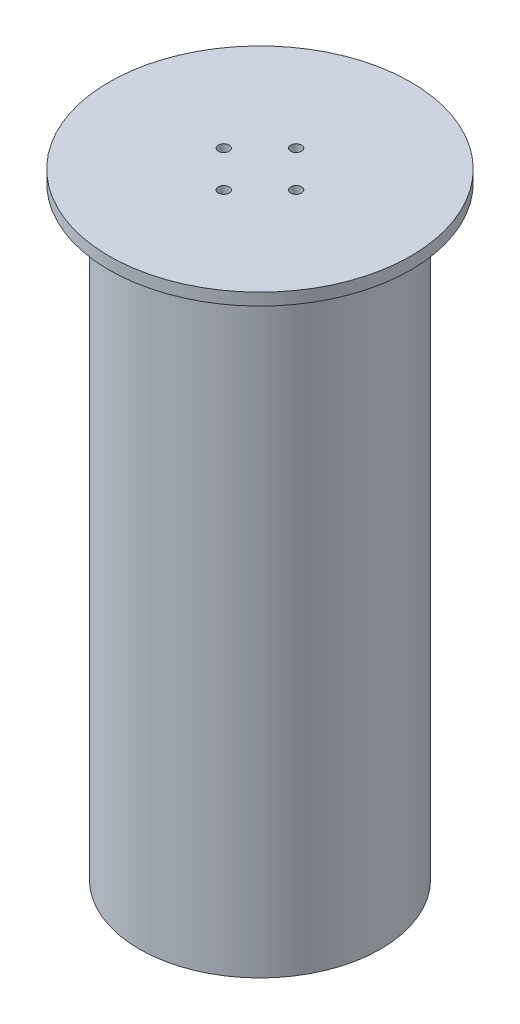
ISO-10303-21;
HEADER;
FILE_DESCRIPTION(('STEP AP214'),'2;1');
FILE_NAME('part.step','',(''),(''),'','','');
FILE_SCHEMA(('AUTOMOTIVE_DESIGN { 1 0 10303 214 1 1 1 1 }'));
ENDSEC;
DATA;
#1=APPLICATION_CONTEXT('core data for automotive mechanical design processes');
#2=APPLICATION_PROTOCOL_DEFINITION('international standard','automotive_design',2000,#1);
#3=PRODUCT_CONTEXT('',#1,'mechanical');
#4=PRODUCT('Part','Part','',(#3));
#5=PRODUCT_RELATED_PRODUCT_CATEGORY('part','',(#4));
#6=PRODUCT_DEFINITION_FORMATION('','',#4);
#7=PRODUCT_DEFINITION_CONTEXT('part definition',#1,'design');
#8=PRODUCT_DEFINITION('design','',#6,#7);
#9=PRODUCT_DEFINITION_SHAPE('','',#8);
#10=(LENGTH_UNIT() NAMED_UNIT(*) SI_UNIT(.MILLI.,.METRE.));
#11=(NAMED_UNIT(*) PLANE_ANGLE_UNIT() SI_UNIT($,.RADIAN.));
#12=(NAMED_UNIT(*) SI_UNIT($,.STERADIAN.) SOLID_ANGLE_UNIT());
#13=UNCERTAINTY_MEASURE_WITH_UNIT(LENGTH_MEASURE(1.E-05),#10,'distance_accuracy_value','');
#14=(GEOMETRIC_REPRESENTATION_CONTEXT(3) GLOBAL_UNCERTAINTY_ASSIGNED_CONTEXT((#13)) GLOBAL_UNIT_ASSIGNED_CONTEXT((#10,
#11,#12)) REPRESENTATION_CONTEXT('',''));
#15=CARTESIAN_POINT('',(0.,0.,0.));
#16=DIRECTION('',(0.,0.,1.));
#17=DIRECTION('',(1.,0.,0.));
#18=AXIS2_PLACEMENT_3D('',#15,#16,#17);
#19=CARTESIAN_POINT('',(94.0000000000001,10.,0.));
#20=DIRECTION('',(0.,1.,0.));
#21=DIRECTION('',(-1.,0.,0.));
#22=AXIS2_PLACEMENT_3D('',#19,#20,#21);
#23=PLANE('',#22);
#24=CARTESIAN_POINT('',(0.,10.,0.));
#25=DIRECTION('',(0.,-1.,0.));
#26=DIRECTION('',(1.,0.,0.));
#27=AXIS2_PLACEMENT_3D('',#24,#25,#26);
#28=CIRCLE('',#27,88.0000000000001);
#29=CARTESIAN_POINT('',(88.0000000000001,10.,0.));
#30=VERTEX_POINT('',#29);
#31=EDGE_CURVE('E10',#30,#30,#28,.T.);
#32=ORIENTED_EDGE('',*,*,#31,.T.);
#33=EDGE_LOOP('',(#32));
#34=FACE_BOUND('',#33,.T.);
#35=CARTESIAN_POINT('',(0.,10.,0.));
#36=DIRECTION('',(0.,-1.,0.));
#37=DIRECTION('',(1.,0.,0.));
#38=AXIS2_PLACEMENT_3D('',#35,#36,#37);
#39=CIRCLE('',#38,94.0000000000001);
#40=CARTESIAN_POINT('',(94.0000000000001,10.,0.));
#41=VERTEX_POINT('',#40);
#42=EDGE_CURVE('E61',#41,#41,#39,.T.);
#43=ORIENTED_EDGE('',*,*,#42,.F.);
#44=EDGE_LOOP('',(#43));
#45=FACE_BOUND('',#44,.T.);
#46=ADVANCED_FACE('F33',(#34,#45),#23,.T.);
#47=CARTESIAN_POINT('',(0.,0.,0.));
#48=DIRECTION('',(0.,-1.,0.));
#49=DIRECTION('',(1.,0.,0.));
#50=AXIS2_PLACEMENT_3D('',#47,#48,#49);
#51=CYLINDRICAL_SURFACE('',#50,88.0000000000001);
#52=CARTESIAN_POINT('',(0.,0.,0.));
#53=DIRECTION('',(0.,-1.,0.));
#54=DIRECTION('',(1.,0.,0.));
#55=AXIS2_PLACEMENT_3D('',#52,#53,#54);
#56=CIRCLE('',#55,88.0000000000001);
#57=CARTESIAN_POINT('',(88.0000000000001,0.,0.));
#58=VERTEX_POINT('',#57);
#59=EDGE_CURVE('E39',#58,#58,#56,.T.);
#60=ORIENTED_EDGE('',*,*,#59,.T.);
#61=EDGE_LOOP('',(#60));
#62=FACE_BOUND('',#61,.T.);
#63=ORIENTED_EDGE('',*,*,#31,.F.);
#64=EDGE_LOOP('',(#63));
#65=FACE_BOUND('',#64,.T.);
#66=ADVANCED_FACE('F125',(#62,#65),#51,.F.);
#67=CARTESIAN_POINT('',(88.0000000000001,0.,0.));
#68=DIRECTION('',(0.,-1.,0.));
#69=DIRECTION('',(1.,0.,0.));
#70=AXIS2_PLACEMENT_3D('',#67,#68,#69);
#71=PLANE('',#70);
#72=CARTESIAN_POINT('',(0.,0.,0.));
#73=DIRECTION('',(0.,-1.,0.));
#74=DIRECTION('',(1.,0.,0.));
#75=AXIS2_PLACEMENT_3D('',#72,#73,#74);
#76=CIRCLE('',#75,100.);
#77=CARTESIAN_POINT('',(100.,0.,0.));
#78=VERTEX_POINT('',#77);
#79=EDGE_CURVE('E43',#78,#78,#76,.T.);
#80=ORIENTED_EDGE('',*,*,#79,.T.);
#81=EDGE_LOOP('',(#80));
#82=FACE_BOUND('',#81,.T.);
#83=ORIENTED_EDGE('',*,*,#59,.F.);
#84=EDGE_LOOP('',(#83));
#85=FACE_BOUND('',#84,.T.);
#86=ADVANCED_FACE('F119',(#82,#85),#71,.T.);
#87=CARTESIAN_POINT('',(0.,0.,0.));
#88=DIRECTION('',(0.,-1.,0.));
#89=DIRECTION('',(1.,0.,0.));
#90=AXIS2_PLACEMENT_3D('',#87,#88,#89);
#91=CYLINDRICAL_SURFACE('',#90,100.);
#92=CARTESIAN_POINT('',(0.,500.,0.));
#93=DIRECTION('',(0.,-1.,0.));
#94=DIRECTION('',(1.,0.,0.));
#95=AXIS2_PLACEMENT_3D('',#92,#93,#94);
#96=CIRCLE('',#95,100.);
#97=CARTESIAN_POINT('',(100.,500.,0.));
#98=VERTEX_POINT('',#97);
#99=EDGE_CURVE('E47',#98,#98,#96,.T.);
#100=ORIENTED_EDGE('',*,*,#99,.T.);
#101=EDGE_LOOP('',(#100));
#102=FACE_BOUND('',#101,.T.);
#103=ORIENTED_EDGE('',*,*,#79,.F.);
#104=EDGE_LOOP('',(#103));
#105=FACE_BOUND('',#104,.T.);
#106=ADVANCED_FACE('F113',(#102,#105),#91,.T.);
#107=CARTESIAN_POINT('',(125.,500.,0.));
#108=DIRECTION('',(0.,-1.,0.));
#109=DIRECTION('',(1.,0.,0.));
#110=AXIS2_PLACEMENT_3D('',#107,#108,#109);
#111=PLANE('',#110);
#112=CARTESIAN_POINT('',(0.,500.,0.));
#113=DIRECTION('',(0.,-1.,0.));
#114=DIRECTION('',(1.,0.,0.));
#115=AXIS2_PLACEMENT_3D('',#112,#113,#114);
#116=CIRCLE('',#115,125.);
#117=CARTESIAN_POINT('',(125.,500.,0.));
#118=VERTEX_POINT('',#117);
#119=EDGE_CURVE('E52',#118,#118,#116,.T.);
#120=ORIENTED_EDGE('',*,*,#119,.T.);
#121=EDGE_LOOP('',(#120));
#122=FACE_BOUND('',#121,.T.);
#123=ORIENTED_EDGE('',*,*,#99,.F.);
#124=EDGE_LOOP('',(#123));
#125=FACE_BOUND('',#124,.T.);
#126=ADVANCED_FACE('F107',(#122,#125),#111,.T.);
#127=CARTESIAN_POINT('',(0.,0.,0.));
#128=DIRECTION('',(0.,-1.,0.));
#129=DIRECTION('',(1.,0.,0.));
#130=AXIS2_PLACEMENT_3D('',#127,#128,#129);
#131=CYLINDRICAL_SURFACE('',#130,125.);
#132=CARTESIAN_POINT('',(0.,510.,0.));
#133=DIRECTION('',(0.,-1.,0.));
#134=DIRECTION('',(1.,0.,0.));
#135=AXIS2_PLACEMENT_3D('',#132,#133,#134);
#136=CIRCLE('',#135,125.);
#137=CARTESIAN_POINT('',(125.,510.,0.));
#138=VERTEX_POINT('',#137);
#139=EDGE_CURVE('E55',#138,#138,#136,.T.);
#140=ORIENTED_EDGE('',*,*,#139,.T.);
#141=EDGE_LOOP('',(#140));
#142=FACE_BOUND('',#141,.T.);
#143=ORIENTED_EDGE('',*,*,#119,.F.);
#144=EDGE_LOOP('',(#143));
#145=FACE_BOUND('',#144,.T.);
#146=ADVANCED_FACE('F95',(#142,#145),#131,.T.);
#147=CARTESIAN_POINT('',(0.,510.,0.));
#148=DIRECTION('',(0.,1.,0.));
#149=DIRECTION('',(-1.,0.,0.));
#150=AXIS2_PLACEMENT_3D('',#147,#148,#149);
#151=PLANE('',#150);
#152=CARTESIAN_POINT('',(-29.9999999999999,510.,0.));
#153=DIRECTION('',(0.,1.,0.));
#154=DIRECTION('',(-1.,0.,0.));
#155=AXIS2_PLACEMENT_3D('',#152,#153,#154);
#156=CIRCLE('',#155,4.50000000000031);
#157=CARTESIAN_POINT('',(-34.5000000000002,510.,0.));
#158=VERTEX_POINT('',#157);
#159=EDGE_CURVE('E80',#158,#158,#156,.T.);
#160=ORIENTED_EDGE('',*,*,#159,.F.);
#161=EDGE_LOOP('',(#160));
#162=FACE_BOUND('',#161,.T.);
#163=CARTESIAN_POINT('',(0.,510.,30.));
#164=DIRECTION('',(0.,1.,0.));
#165=DIRECTION('',(-1.,0.,0.));
#166=AXIS2_PLACEMENT_3D('',#163,#164,#165);
#167=CIRCLE('',#166,4.50000000000021);
#168=CARTESIAN_POINT('',(-4.50000000000014,510.,30.));
#169=VERTEX_POINT('',#168);
#170=EDGE_CURVE('E74',#169,#169,#167,.T.);
#171=ORIENTED_EDGE('',*,*,#170,.F.);
#172=EDGE_LOOP('',(#171));
#173=FACE_BOUND('',#172,.T.);
#174=CARTESIAN_POINT('',(30.0000000000001,510.,0.));
#175=DIRECTION('',(0.,1.,0.));
#176=DIRECTION('',(-1.,0.,0.));
#177=AXIS2_PLACEMENT_3D('',#174,#175,#176);
#178=CIRCLE('',#177,4.5000000000001);
#179=CARTESIAN_POINT('',(25.5,510.,0.));
#180=VERTEX_POINT('',#179);
#181=EDGE_CURVE('E68',#180,#180,#178,.T.);
#182=ORIENTED_EDGE('',*,*,#181,.F.);
#183=EDGE_LOOP('',(#182));
#184=FACE_BOUND('',#183,.T.);
#185=CARTESIAN_POINT('',(0.,510.,-30.));
#186=DIRECTION('',(0.,1.,0.));
#187=DIRECTION('',(-1.,0.,0.));
#188=AXIS2_PLACEMENT_3D('',#185,#186,#187);
#189=CIRCLE('',#188,4.5);
#190=CARTESIAN_POINT('',(-4.49999999999994,510.,-30.));
#191=VERTEX_POINT('',#190);
#192=EDGE_CURVE('E64',#191,#191,#189,.T.);
#193=ORIENTED_EDGE('',*,*,#192,.F.);
#194=EDGE_LOOP('',(#193));
#195=FACE_BOUND('',#194,.T.);
#196=ORIENTED_EDGE('',*,*,#139,.F.);
#197=EDGE_LOOP('',(#196));
#198=FACE_BOUND('',#197,.T.);
#199=ADVANCED_FACE('F91',(#162,#173,#184,#195,#198),#151,.T.);
#200=CARTESIAN_POINT('',(94.0000000000001,500.,0.));
#201=DIRECTION('',(0.,-1.,0.));
#202=DIRECTION('',(1.,0.,0.));
#203=AXIS2_PLACEMENT_3D('',#200,#201,#202);
#204=PLANE('',#203);
#205=CARTESIAN_POINT('',(-29.9999999999999,500.,0.));
#206=DIRECTION('',(0.,-1.,0.));
#207=DIRECTION('',(1.,0.,0.));
#208=AXIS2_PLACEMENT_3D('',#205,#206,#207);
#209=CIRCLE('',#208,4.50000000000031);
#210=CARTESIAN_POINT('',(-25.4999999999996,500.,0.));
#211=VERTEX_POINT('',#210);
#212=EDGE_CURVE('E83',#211,#211,#209,.F.);
#213=ORIENTED_EDGE('',*,*,#212,.T.);
#214=EDGE_LOOP('',(#213));
#215=FACE_BOUND('',#214,.T.);
#216=CARTESIAN_POINT('',(0.,500.,30.));
#217=DIRECTION('',(0.,-1.,0.));
#218=DIRECTION('',(1.,0.,0.));
#219=AXIS2_PLACEMENT_3D('',#216,#217,#218);
#220=CIRCLE('',#219,4.50000000000021);
#221=CARTESIAN_POINT('',(4.50000000000027,500.,30.));
#222=VERTEX_POINT('',#221);
#223=EDGE_CURVE('E77',#222,#222,#220,.F.);
#224=ORIENTED_EDGE('',*,*,#223,.T.);
#225=EDGE_LOOP('',(#224));
#226=FACE_BOUND('',#225,.T.);
#227=CARTESIAN_POINT('',(30.0000000000001,500.,0.));
#228=DIRECTION('',(0.,-1.,0.));
#229=DIRECTION('',(1.,0.,0.));
#230=AXIS2_PLACEMENT_3D('',#227,#228,#229);
#231=CIRCLE('',#230,4.5000000000001);
#232=CARTESIAN_POINT('',(34.5000000000002,500.,0.));
#233=VERTEX_POINT('',#232);
#234=EDGE_CURVE('E71',#233,#233,#231,.F.);
#235=ORIENTED_EDGE('',*,*,#234,.T.);
#236=EDGE_LOOP('',(#235));
#237=FACE_BOUND('',#236,.T.);
#238=CARTESIAN_POINT('',(0.,500.,-30.));
#239=DIRECTION('',(0.,-1.,0.));
#240=DIRECTION('',(1.,0.,0.));
#241=AXIS2_PLACEMENT_3D('',#238,#239,#240);
#242=CIRCLE('',#241,4.5);
#243=CARTESIAN_POINT('',(4.50000000000006,500.,-30.));
#244=VERTEX_POINT('',#243);
#245=EDGE_CURVE('E65',#244,#244,#242,.F.);
#246=ORIENTED_EDGE('',*,*,#245,.T.);
#247=EDGE_LOOP('',(#246));
#248=FACE_BOUND('',#247,.T.);
#249=CARTESIAN_POINT('',(0.,500.,0.));
#250=DIRECTION('',(0.,-1.,0.));
#251=DIRECTION('',(1.,0.,0.));
#252=AXIS2_PLACEMENT_3D('',#249,#250,#251);
#253=CIRCLE('',#252,94.0000000000001);
#254=CARTESIAN_POINT('',(94.0000000000001,500.,0.));
#255=VERTEX_POINT('',#254);
#256=EDGE_CURVE('E58',#255,#255,#253,.T.);
#257=ORIENTED_EDGE('',*,*,#256,.T.);
#258=EDGE_LOOP('',(#257));
#259=FACE_BOUND('',#258,.T.);
#260=ADVANCED_FACE('F94',(#215,#226,#237,#248,#259),#204,.T.);
#261=CARTESIAN_POINT('',(0.,0.,0.));
#262=DIRECTION('',(0.,-1.,0.));
#263=DIRECTION('',(1.,0.,0.));
#264=AXIS2_PLACEMENT_3D('',#261,#262,#263);
#265=CYLINDRICAL_SURFACE('',#264,94.0000000000001);
#266=ORIENTED_EDGE('',*,*,#42,.T.);
#267=EDGE_LOOP('',(#266));
#268=FACE_BOUND('',#267,.T.);
#269=ORIENTED_EDGE('',*,*,#256,.F.);
#270=EDGE_LOOP('',(#269));
#271=FACE_BOUND('',#270,.T.);
#272=ADVANCED_FACE('F136',(#268,#271),#265,.F.);
#273=CARTESIAN_POINT('',(0.,-0.00100000000002876,-30.));
#274=DIRECTION('',(0.,1.,0.));
#275=DIRECTION('',(-1.,0.,0.));
#276=AXIS2_PLACEMENT_3D('',#273,#274,#275);
#277=CYLINDRICAL_SURFACE('',#276,4.5);
#278=ORIENTED_EDGE('',*,*,#245,.F.);
#279=EDGE_LOOP('',(#278));
#280=FACE_BOUND('',#279,.T.);
#281=ORIENTED_EDGE('',*,*,#192,.T.);
#282=EDGE_LOOP('',(#281));
#283=FACE_BOUND('',#282,.T.);
#284=ADVANCED_FACE('F139',(#280,#283),#277,.F.);
#285=CARTESIAN_POINT('',(30.,-0.00100000000002876,0.));
#286=DIRECTION('',(0.,1.,0.));
#287=DIRECTION('',(-1.,0.,0.));
#288=AXIS2_PLACEMENT_3D('',#285,#286,#287);
#289=CYLINDRICAL_SURFACE('',#288,4.5000000000001);
#290=ORIENTED_EDGE('',*,*,#234,.F.);
#291=EDGE_LOOP('',(#290));
#292=FACE_BOUND('',#291,.T.);
#293=ORIENTED_EDGE('',*,*,#181,.T.);
#294=EDGE_LOOP('',(#293));
#295=FACE_BOUND('',#294,.T.);
#296=ADVANCED_FACE('F152',(#292,#295),#289,.F.);
#297=CARTESIAN_POINT('',(0.,-0.00100000000002876,30.));
#298=DIRECTION('',(0.,1.,0.));
#299=DIRECTION('',(-1.,0.,0.));
#300=AXIS2_PLACEMENT_3D('',#297,#298,#299);
#301=CYLINDRICAL_SURFACE('',#300,4.50000000000021);
#302=ORIENTED_EDGE('',*,*,#223,.F.);
#303=EDGE_LOOP('',(#302));
#304=FACE_BOUND('',#303,.T.);
#305=ORIENTED_EDGE('',*,*,#170,.T.);
#306=EDGE_LOOP('',(#305));
#307=FACE_BOUND('',#306,.T.);
#308=ADVANCED_FACE('F156',(#304,#307),#301,.F.);
#309=CARTESIAN_POINT('',(-30.,-0.00100000000002876,0.));
#310=DIRECTION('',(0.,1.,0.));
#311=DIRECTION('',(-1.,0.,0.));
#312=AXIS2_PLACEMENT_3D('',#309,#310,#311);
#313=CYLINDRICAL_SURFACE('',#312,4.50000000000031);
#314=ORIENTED_EDGE('',*,*,#212,.F.);
#315=EDGE_LOOP('',(#314));
#316=FACE_BOUND('',#315,.T.);
#317=ORIENTED_EDGE('',*,*,#159,.T.);
#318=EDGE_LOOP('',(#317));
#319=FACE_BOUND('',#318,.T.);
#320=ADVANCED_FACE('F89',(#316,#319),#313,.F.);
#321=CLOSED_SHELL('',(#46,#66,#86,#106,#126,#146,#199,#260,#272,#284,#296,#308,#320));
#322=MANIFOLD_SOLID_BREP('B2',#321);
#323=ADVANCED_BREP_SHAPE_REPRESENTATION('',(#18,#322),#14);
#324=SHAPE_DEFINITION_REPRESENTATION(#9,#323);
ENDSEC;
END-ISO-10303-21;
